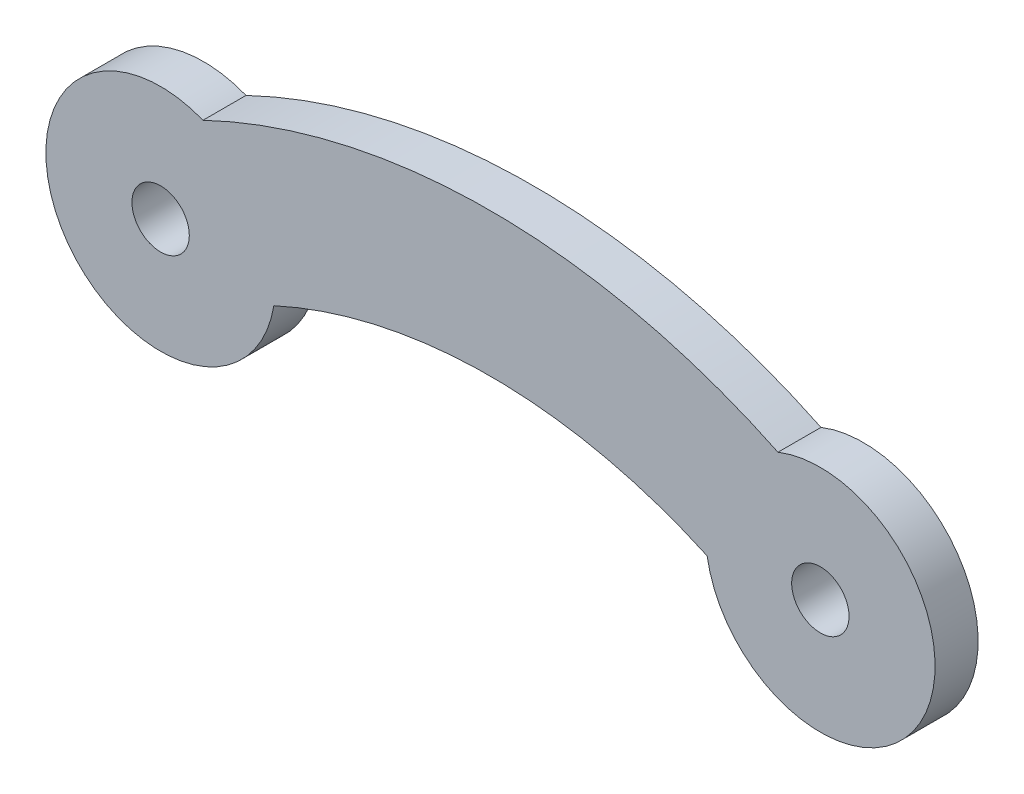
ISO-10303-21;
HEADER;
FILE_DESCRIPTION(('STEP AP214'),'2;1');
FILE_NAME('part.step','',(''),(''),'','','');
FILE_SCHEMA(('AUTOMOTIVE_DESIGN { 1 0 10303 214 1 1 1 1 }'));
ENDSEC;
DATA;
#1=APPLICATION_CONTEXT('core data for automotive mechanical design processes');
#2=APPLICATION_PROTOCOL_DEFINITION('international standard','automotive_design',2000,#1);
#3=PRODUCT_CONTEXT('',#1,'mechanical');
#4=PRODUCT('Part','Part','',(#3));
#5=PRODUCT_RELATED_PRODUCT_CATEGORY('part','',(#4));
#6=PRODUCT_DEFINITION_FORMATION('','',#4);
#7=PRODUCT_DEFINITION_CONTEXT('part definition',#1,'design');
#8=PRODUCT_DEFINITION('design','',#6,#7);
#9=PRODUCT_DEFINITION_SHAPE('','',#8);
#10=(LENGTH_UNIT() NAMED_UNIT(*) SI_UNIT(.MILLI.,.METRE.));
#11=(NAMED_UNIT(*) PLANE_ANGLE_UNIT() SI_UNIT($,.RADIAN.));
#12=(NAMED_UNIT(*) SI_UNIT($,.STERADIAN.) SOLID_ANGLE_UNIT());
#13=UNCERTAINTY_MEASURE_WITH_UNIT(LENGTH_MEASURE(1.E-05),#10,'distance_accuracy_value','');
#14=(GEOMETRIC_REPRESENTATION_CONTEXT(3) GLOBAL_UNCERTAINTY_ASSIGNED_CONTEXT((#13)) GLOBAL_UNIT_ASSIGNED_CONTEXT((#10,
#11,#12)) REPRESENTATION_CONTEXT('',''));
#15=CARTESIAN_POINT('',(0.,0.,0.));
#16=DIRECTION('',(0.,0.,1.));
#17=DIRECTION('',(1.,0.,0.));
#18=AXIS2_PLACEMENT_3D('',#15,#16,#17);
#19=CARTESIAN_POINT('',(17.25,-8.57142857142854,1.5));
#20=DIRECTION('',(0.,0.,-1.));
#21=DIRECTION('',(-1.,0.,0.));
#22=AXIS2_PLACEMENT_3D('',#19,#20,#21);
#23=PLANE('',#22);
#24=CARTESIAN_POINT('',(11.5,-17.1428571428571,1.5));
#25=DIRECTION('',(0.,0.,-1.));
#26=DIRECTION('',(-1.,0.,0.));
#27=AXIS2_PLACEMENT_3D('',#24,#25,#26);
#28=CIRCLE('',#27,18.1428571428571);
#29=CARTESIAN_POINT('',(3.94736516636985,-0.646767534226906,1.5));
#30=VERTEX_POINT('',#29);
#31=CARTESIAN_POINT('',(19.0526348336302,-0.646767534226903,1.5));
#32=VERTEX_POINT('',#31);
#33=EDGE_CURVE('E92',#30,#32,#28,.T.);
#34=ORIENTED_EDGE('',*,*,#33,.T.);
#35=CARTESIAN_POINT('',(23.,0.,1.5));
#36=DIRECTION('',(0.,0.,1.));
#37=DIRECTION('',(1.,0.,0.));
#38=AXIS2_PLACEMENT_3D('',#35,#36,#37);
#39=CIRCLE('',#38,4.);
#40=CARTESIAN_POINT('',(21.5225713412101,3.71715005860488,1.5));
#41=VERTEX_POINT('',#40);
#42=EDGE_CURVE('E87',#32,#41,#39,.T.);
#43=ORIENTED_EDGE('',*,*,#42,.T.);
#44=CARTESIAN_POINT('',(11.5,-17.1428571428571,1.5));
#45=DIRECTION('',(0.,0.,1.));
#46=DIRECTION('',(-1.,0.,0.));
#47=AXIS2_PLACEMENT_3D('',#44,#45,#46);
#48=CIRCLE('',#47,23.1428571428571);
#49=CARTESIAN_POINT('',(1.4774286587899,3.71715005860488,1.5));
#50=VERTEX_POINT('',#49);
#51=EDGE_CURVE('E90',#41,#50,#48,.T.);
#52=ORIENTED_EDGE('',*,*,#51,.T.);
#53=CARTESIAN_POINT('',(0.,0.,1.5));
#54=DIRECTION('',(0.,0.,1.));
#55=DIRECTION('',(1.,0.,0.));
#56=AXIS2_PLACEMENT_3D('',#53,#54,#55);
#57=CIRCLE('',#56,4.);
#58=EDGE_CURVE('E57',#50,#30,#57,.T.);
#59=ORIENTED_EDGE('',*,*,#58,.T.);
#60=EDGE_LOOP('',(#34,#43,#52,#59));
#61=FACE_BOUND('',#60,.T.);
#62=CARTESIAN_POINT('',(0.,0.,1.5));
#63=DIRECTION('',(0.,0.,1.));
#64=DIRECTION('',(1.,0.,0.));
#65=AXIS2_PLACEMENT_3D('',#62,#63,#64);
#66=CIRCLE('',#65,1.);
#67=CARTESIAN_POINT('',(1.,0.,1.5));
#68=VERTEX_POINT('',#67);
#69=EDGE_CURVE('E112',#68,#68,#66,.T.);
#70=ORIENTED_EDGE('',*,*,#69,.F.);
#71=EDGE_LOOP('',(#70));
#72=FACE_BOUND('',#71,.T.);
#73=CARTESIAN_POINT('',(23.,0.,1.5));
#74=DIRECTION('',(0.,0.,1.));
#75=DIRECTION('',(1.,0.,0.));
#76=AXIS2_PLACEMENT_3D('',#73,#74,#75);
#77=CIRCLE('',#76,1.);
#78=CARTESIAN_POINT('',(24.,0.,1.5));
#79=VERTEX_POINT('',#78);
#80=EDGE_CURVE('E134',#79,#79,#77,.T.);
#81=ORIENTED_EDGE('',*,*,#80,.F.);
#82=EDGE_LOOP('',(#81));
#83=FACE_BOUND('',#82,.T.);
#84=ADVANCED_FACE('F39',(#61,#72,#83),#23,.F.);
#85=CARTESIAN_POINT('',(17.25,-8.57142857142854,0.));
#86=DIRECTION('',(0.,0.,-1.));
#87=DIRECTION('',(-1.,0.,0.));
#88=AXIS2_PLACEMENT_3D('',#85,#86,#87);
#89=PLANE('',#88);
#90=CARTESIAN_POINT('',(0.,0.,0.));
#91=DIRECTION('',(0.,0.,1.));
#92=DIRECTION('',(1.,0.,0.));
#93=AXIS2_PLACEMENT_3D('',#90,#91,#92);
#94=CIRCLE('',#93,1.);
#95=CARTESIAN_POINT('',(1.,0.,0.));
#96=VERTEX_POINT('',#95);
#97=EDGE_CURVE('E130',#96,#96,#94,.T.);
#98=ORIENTED_EDGE('',*,*,#97,.T.);
#99=EDGE_LOOP('',(#98));
#100=FACE_BOUND('',#99,.T.);
#101=CARTESIAN_POINT('',(11.5,-17.1428571428571,0.));
#102=DIRECTION('',(0.,0.,-1.));
#103=DIRECTION('',(-1.,0.,0.));
#104=AXIS2_PLACEMENT_3D('',#101,#102,#103);
#105=CIRCLE('',#104,18.1428571428571);
#106=CARTESIAN_POINT('',(3.94736516636985,-0.646767534226906,0.));
#107=VERTEX_POINT('',#106);
#108=CARTESIAN_POINT('',(19.0526348336302,-0.646767534226903,0.));
#109=VERTEX_POINT('',#108);
#110=EDGE_CURVE('E108',#107,#109,#105,.T.);
#111=ORIENTED_EDGE('',*,*,#110,.F.);
#112=CARTESIAN_POINT('',(0.,0.,0.));
#113=DIRECTION('',(0.,0.,1.));
#114=DIRECTION('',(1.,0.,0.));
#115=AXIS2_PLACEMENT_3D('',#112,#113,#114);
#116=CIRCLE('',#115,4.);
#117=CARTESIAN_POINT('',(1.4774286587899,3.71715005860488,0.));
#118=VERTEX_POINT('',#117);
#119=EDGE_CURVE('E80',#118,#107,#116,.T.);
#120=ORIENTED_EDGE('',*,*,#119,.F.);
#121=CARTESIAN_POINT('',(11.5,-17.1428571428571,0.));
#122=DIRECTION('',(0.,0.,1.));
#123=DIRECTION('',(-1.,0.,0.));
#124=AXIS2_PLACEMENT_3D('',#121,#122,#123);
#125=CIRCLE('',#124,23.1428571428571);
#126=CARTESIAN_POINT('',(21.5225713412101,3.71715005860488,0.));
#127=VERTEX_POINT('',#126);
#128=EDGE_CURVE('E74',#127,#118,#125,.T.);
#129=ORIENTED_EDGE('',*,*,#128,.F.);
#130=CARTESIAN_POINT('',(23.,0.,0.));
#131=DIRECTION('',(0.,0.,1.));
#132=DIRECTION('',(1.,0.,0.));
#133=AXIS2_PLACEMENT_3D('',#130,#131,#132);
#134=CIRCLE('',#133,4.);
#135=EDGE_CURVE('E97',#109,#127,#134,.T.);
#136=ORIENTED_EDGE('',*,*,#135,.F.);
#137=EDGE_LOOP('',(#111,#120,#129,#136));
#138=FACE_BOUND('',#137,.T.);
#139=CARTESIAN_POINT('',(23.,0.,0.));
#140=DIRECTION('',(0.,0.,1.));
#141=DIRECTION('',(1.,0.,0.));
#142=AXIS2_PLACEMENT_3D('',#139,#140,#141);
#143=CIRCLE('',#142,1.);
#144=CARTESIAN_POINT('',(24.,0.,0.));
#145=VERTEX_POINT('',#144);
#146=EDGE_CURVE('E138',#145,#145,#143,.T.);
#147=ORIENTED_EDGE('',*,*,#146,.T.);
#148=EDGE_LOOP('',(#147));
#149=FACE_BOUND('',#148,.T.);
#150=ADVANCED_FACE('F125',(#100,#138,#149),#89,.T.);
#151=CARTESIAN_POINT('',(11.5,-17.1428571428571,1.5));
#152=DIRECTION('',(0.,0.,-1.));
#153=DIRECTION('',(-1.,0.,0.));
#154=AXIS2_PLACEMENT_3D('',#151,#152,#153);
#155=CYLINDRICAL_SURFACE('',#154,18.1428571428571);
#156=ORIENTED_EDGE('',*,*,#110,.T.);
#157=DIRECTION('',(0.,0.,-1.));
#158=VECTOR('',#157,1.);
#159=CARTESIAN_POINT('',(19.0526348336302,-0.646767534226903,1.5));
#160=LINE('',#159,#158);
#161=EDGE_CURVE('E11',#32,#109,#160,.T.);
#162=ORIENTED_EDGE('',*,*,#161,.F.);
#163=ORIENTED_EDGE('',*,*,#33,.F.);
#164=DIRECTION('',(0.,0.,-1.));
#165=VECTOR('',#164,1.);
#166=CARTESIAN_POINT('',(3.94736516636985,-0.646767534226906,1.5));
#167=LINE('',#166,#165);
#168=EDGE_CURVE('E104',#30,#107,#167,.T.);
#169=ORIENTED_EDGE('',*,*,#168,.T.);
#170=EDGE_LOOP('',(#156,#162,#163,#169));
#171=FACE_BOUND('',#170,.T.);
#172=ADVANCED_FACE('F41',(#171),#155,.F.);
#173=CARTESIAN_POINT('',(23.,0.,1.5));
#174=DIRECTION('',(0.,0.,-1.));
#175=DIRECTION('',(-1.,0.,0.));
#176=AXIS2_PLACEMENT_3D('',#173,#174,#175);
#177=CYLINDRICAL_SURFACE('',#176,4.);
#178=ORIENTED_EDGE('',*,*,#135,.T.);
#179=DIRECTION('',(0.,0.,-1.));
#180=VECTOR('',#179,1.);
#181=CARTESIAN_POINT('',(21.5225713412101,3.71715005860488,1.5));
#182=LINE('',#181,#180);
#183=EDGE_CURVE('E49',#41,#127,#182,.T.);
#184=ORIENTED_EDGE('',*,*,#183,.F.);
#185=ORIENTED_EDGE('',*,*,#42,.F.);
#186=ORIENTED_EDGE('',*,*,#161,.T.);
#187=EDGE_LOOP('',(#178,#184,#185,#186));
#188=FACE_BOUND('',#187,.T.);
#189=ADVANCED_FACE('F96',(#188),#177,.T.);
#190=CARTESIAN_POINT('',(11.5,-17.1428571428571,1.5));
#191=DIRECTION('',(0.,0.,-1.));
#192=DIRECTION('',(-1.,0.,0.));
#193=AXIS2_PLACEMENT_3D('',#190,#191,#192);
#194=CYLINDRICAL_SURFACE('',#193,23.1428571428571);
#195=ORIENTED_EDGE('',*,*,#128,.T.);
#196=DIRECTION('',(0.,0.,-1.));
#197=VECTOR('',#196,1.);
#198=CARTESIAN_POINT('',(1.4774286587899,3.71715005860488,1.5));
#199=LINE('',#198,#197);
#200=EDGE_CURVE('E99',#50,#118,#199,.T.);
#201=ORIENTED_EDGE('',*,*,#200,.F.);
#202=ORIENTED_EDGE('',*,*,#51,.F.);
#203=ORIENTED_EDGE('',*,*,#183,.T.);
#204=EDGE_LOOP('',(#195,#201,#202,#203));
#205=FACE_BOUND('',#204,.T.);
#206=ADVANCED_FACE('F100',(#205),#194,.T.);
#207=CARTESIAN_POINT('',(0.,0.,1.5));
#208=DIRECTION('',(0.,0.,-1.));
#209=DIRECTION('',(-1.,0.,0.));
#210=AXIS2_PLACEMENT_3D('',#207,#208,#209);
#211=CYLINDRICAL_SURFACE('',#210,4.);
#212=ORIENTED_EDGE('',*,*,#119,.T.);
#213=ORIENTED_EDGE('',*,*,#168,.F.);
#214=ORIENTED_EDGE('',*,*,#58,.F.);
#215=ORIENTED_EDGE('',*,*,#200,.T.);
#216=EDGE_LOOP('',(#212,#213,#214,#215));
#217=FACE_BOUND('',#216,.T.);
#218=ADVANCED_FACE('F122',(#217),#211,.T.);
#219=CARTESIAN_POINT('',(0.,0.,1.5));
#220=DIRECTION('',(0.,0.,-1.));
#221=DIRECTION('',(-1.,0.,0.));
#222=AXIS2_PLACEMENT_3D('',#219,#220,#221);
#223=CYLINDRICAL_SURFACE('',#222,1.);
#224=ORIENTED_EDGE('',*,*,#69,.T.);
#225=EDGE_LOOP('',(#224));
#226=FACE_BOUND('',#225,.T.);
#227=ORIENTED_EDGE('',*,*,#97,.F.);
#228=EDGE_LOOP('',(#227));
#229=FACE_BOUND('',#228,.T.);
#230=ADVANCED_FACE('F157',(#226,#229),#223,.F.);
#231=CARTESIAN_POINT('',(23.,0.,1.5));
#232=DIRECTION('',(0.,0.,-1.));
#233=DIRECTION('',(-1.,0.,0.));
#234=AXIS2_PLACEMENT_3D('',#231,#232,#233);
#235=CYLINDRICAL_SURFACE('',#234,1.);
#236=ORIENTED_EDGE('',*,*,#80,.T.);
#237=EDGE_LOOP('',(#236));
#238=FACE_BOUND('',#237,.T.);
#239=ORIENTED_EDGE('',*,*,#146,.F.);
#240=EDGE_LOOP('',(#239));
#241=FACE_BOUND('',#240,.T.);
#242=ADVANCED_FACE('F146',(#238,#241),#235,.F.);
#243=CLOSED_SHELL('',(#84,#150,#172,#189,#206,#218,#230,#242));
#244=MANIFOLD_SOLID_BREP('B2',#243);
#245=ADVANCED_BREP_SHAPE_REPRESENTATION('',(#18,#244),#14);
#246=SHAPE_DEFINITION_REPRESENTATION(#9,#245);
ENDSEC;
END-ISO-10303-21;
